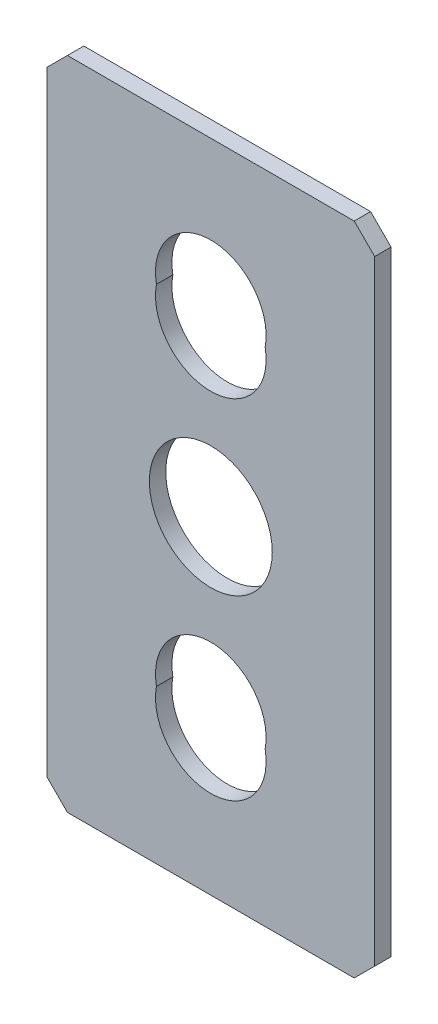
ISO-10303-21;
HEADER;
FILE_DESCRIPTION(('STEP AP214'),'2;1');
FILE_NAME('part.step','',(''),(''),'','','');
FILE_SCHEMA(('AUTOMOTIVE_DESIGN { 1 0 10303 214 1 1 1 1 }'));
ENDSEC;
DATA;
#1=APPLICATION_CONTEXT('core data for automotive mechanical design processes');
#2=APPLICATION_PROTOCOL_DEFINITION('international standard','automotive_design',2000,#1);
#3=PRODUCT_CONTEXT('',#1,'mechanical');
#4=PRODUCT('Part','Part','',(#3));
#5=PRODUCT_RELATED_PRODUCT_CATEGORY('part','',(#4));
#6=PRODUCT_DEFINITION_FORMATION('','',#4);
#7=PRODUCT_DEFINITION_CONTEXT('part definition',#1,'design');
#8=PRODUCT_DEFINITION('design','',#6,#7);
#9=PRODUCT_DEFINITION_SHAPE('','',#8);
#10=(LENGTH_UNIT() NAMED_UNIT(*) SI_UNIT(.MILLI.,.METRE.));
#11=(NAMED_UNIT(*) PLANE_ANGLE_UNIT() SI_UNIT($,.RADIAN.));
#12=(NAMED_UNIT(*) SI_UNIT($,.STERADIAN.) SOLID_ANGLE_UNIT());
#13=UNCERTAINTY_MEASURE_WITH_UNIT(LENGTH_MEASURE(1.E-05),#10,'distance_accuracy_value','');
#14=(GEOMETRIC_REPRESENTATION_CONTEXT(3) GLOBAL_UNCERTAINTY_ASSIGNED_CONTEXT((#13)) GLOBAL_UNIT_ASSIGNED_CONTEXT((#10,
#11,#12)) REPRESENTATION_CONTEXT('',''));
#15=CARTESIAN_POINT('',(0.,0.,0.));
#16=DIRECTION('',(0.,0.,1.));
#17=DIRECTION('',(1.,0.,0.));
#18=AXIS2_PLACEMENT_3D('',#15,#16,#17);
#19=CARTESIAN_POINT('',(-20.,-40.,-2.));
#20=DIRECTION('',(-1.,0.,0.));
#21=DIRECTION('',(0.,0.,1.));
#22=AXIS2_PLACEMENT_3D('',#19,#20,#21);
#23=PLANE('',#22);
#24=DIRECTION('',(0.,-1.,0.));
#25=VECTOR('',#24,1.);
#26=CARTESIAN_POINT('',(-20.,-40.,-2.));
#27=LINE('',#26,#25);
#28=CARTESIAN_POINT('',(-20.,37.5,-2.));
#29=VERTEX_POINT('',#28);
#30=CARTESIAN_POINT('',(-20.,-37.5,-2.));
#31=VERTEX_POINT('',#30);
#32=EDGE_CURVE('E164',#29,#31,#27,.T.);
#33=ORIENTED_EDGE('',*,*,#32,.T.);
#34=DIRECTION('',(0.,0.,1.));
#35=VECTOR('',#34,1.);
#36=CARTESIAN_POINT('',(-20.,-37.5,-2.));
#37=LINE('',#36,#35);
#38=CARTESIAN_POINT('',(-20.,-37.5,0.));
#39=VERTEX_POINT('',#38);
#40=EDGE_CURVE('E197',#31,#39,#37,.T.);
#41=ORIENTED_EDGE('',*,*,#40,.T.);
#42=DIRECTION('',(0.,-1.,0.));
#43=VECTOR('',#42,1.);
#44=CARTESIAN_POINT('',(-20.,-40.,0.));
#45=LINE('',#44,#43);
#46=CARTESIAN_POINT('',(-20.,37.5,0.));
#47=VERTEX_POINT('',#46);
#48=EDGE_CURVE('E177',#47,#39,#45,.T.);
#49=ORIENTED_EDGE('',*,*,#48,.F.);
#50=DIRECTION('',(0.,0.,-1.));
#51=VECTOR('',#50,1.);
#52=CARTESIAN_POINT('',(-20.,37.5,-2.));
#53=LINE('',#52,#51);
#54=EDGE_CURVE('E148',#47,#29,#53,.T.);
#55=ORIENTED_EDGE('',*,*,#54,.T.);
#56=EDGE_LOOP('',(#33,#41,#49,#55));
#57=FACE_BOUND('',#56,.T.);
#58=ADVANCED_FACE('F39',(#57),#23,.T.);
#59=CARTESIAN_POINT('',(20.,40.,-2.));
#60=DIRECTION('',(0.,1.,0.));
#61=DIRECTION('',(-1.,0.,0.));
#62=AXIS2_PLACEMENT_3D('',#59,#60,#61);
#63=PLANE('',#62);
#64=DIRECTION('',(-1.,0.,0.));
#65=VECTOR('',#64,1.);
#66=CARTESIAN_POINT('',(20.,40.,-2.));
#67=LINE('',#66,#65);
#68=CARTESIAN_POINT('',(17.5,40.,-2.));
#69=VERTEX_POINT('',#68);
#70=CARTESIAN_POINT('',(-17.5,40.,-2.));
#71=VERTEX_POINT('',#70);
#72=EDGE_CURVE('E173',#69,#71,#67,.T.);
#73=ORIENTED_EDGE('',*,*,#72,.T.);
#74=DIRECTION('',(0.,0.,1.));
#75=VECTOR('',#74,1.);
#76=CARTESIAN_POINT('',(-17.5,40.,-2.));
#77=LINE('',#76,#75);
#78=CARTESIAN_POINT('',(-17.5,40.,0.));
#79=VERTEX_POINT('',#78);
#80=EDGE_CURVE('E11',#71,#79,#77,.T.);
#81=ORIENTED_EDGE('',*,*,#80,.T.);
#82=DIRECTION('',(-1.,0.,0.));
#83=VECTOR('',#82,1.);
#84=CARTESIAN_POINT('',(20.,40.,0.));
#85=LINE('',#84,#83);
#86=CARTESIAN_POINT('',(17.5,40.,0.));
#87=VERTEX_POINT('',#86);
#88=EDGE_CURVE('E168',#87,#79,#85,.T.);
#89=ORIENTED_EDGE('',*,*,#88,.F.);
#90=DIRECTION('',(0.,0.,-1.));
#91=VECTOR('',#90,1.);
#92=CARTESIAN_POINT('',(17.5,40.,-2.));
#93=LINE('',#92,#91);
#94=EDGE_CURVE('E47',#87,#69,#93,.T.);
#95=ORIENTED_EDGE('',*,*,#94,.T.);
#96=EDGE_LOOP('',(#73,#81,#89,#95));
#97=FACE_BOUND('',#96,.T.);
#98=ADVANCED_FACE('F226',(#97),#63,.T.);
#99=CARTESIAN_POINT('',(20.,-40.,-2.));
#100=DIRECTION('',(1.,0.,0.));
#101=DIRECTION('',(0.,0.,-1.));
#102=AXIS2_PLACEMENT_3D('',#99,#100,#101);
#103=PLANE('',#102);
#104=DIRECTION('',(0.,1.,0.));
#105=VECTOR('',#104,1.);
#106=CARTESIAN_POINT('',(20.,-40.,0.));
#107=LINE('',#106,#105);
#108=CARTESIAN_POINT('',(20.,-37.5,0.));
#109=VERTEX_POINT('',#108);
#110=CARTESIAN_POINT('',(20.,37.5,0.));
#111=VERTEX_POINT('',#110);
#112=EDGE_CURVE('E183',#109,#111,#107,.T.);
#113=ORIENTED_EDGE('',*,*,#112,.F.);
#114=DIRECTION('',(0.,0.,-1.));
#115=VECTOR('',#114,1.);
#116=CARTESIAN_POINT('',(20.,-37.5,-2.));
#117=LINE('',#116,#115);
#118=CARTESIAN_POINT('',(20.,-37.5,-2.));
#119=VERTEX_POINT('',#118);
#120=EDGE_CURVE('E61',#109,#119,#117,.T.);
#121=ORIENTED_EDGE('',*,*,#120,.T.);
#122=DIRECTION('',(0.,1.,0.));
#123=VECTOR('',#122,1.);
#124=CARTESIAN_POINT('',(20.,-40.,-2.));
#125=LINE('',#124,#123);
#126=CARTESIAN_POINT('',(20.,37.5,-2.));
#127=VERTEX_POINT('',#126);
#128=EDGE_CURVE('E171',#119,#127,#125,.T.);
#129=ORIENTED_EDGE('',*,*,#128,.T.);
#130=DIRECTION('',(0.,0.,1.));
#131=VECTOR('',#130,1.);
#132=CARTESIAN_POINT('',(20.,37.5,-2.));
#133=LINE('',#132,#131);
#134=EDGE_CURVE('E220',#127,#111,#133,.T.);
#135=ORIENTED_EDGE('',*,*,#134,.T.);
#136=EDGE_LOOP('',(#113,#121,#129,#135));
#137=FACE_BOUND('',#136,.T.);
#138=ADVANCED_FACE('F234',(#137),#103,.T.);
#139=CARTESIAN_POINT('',(20.,-40.,-2.));
#140=DIRECTION('',(0.,-1.,0.));
#141=DIRECTION('',(1.,0.,0.));
#142=AXIS2_PLACEMENT_3D('',#139,#140,#141);
#143=PLANE('',#142);
#144=DIRECTION('',(1.,0.,0.));
#145=VECTOR('',#144,1.);
#146=CARTESIAN_POINT('',(20.,-40.,0.));
#147=LINE('',#146,#145);
#148=CARTESIAN_POINT('',(-17.5,-40.,0.));
#149=VERTEX_POINT('',#148);
#150=CARTESIAN_POINT('',(17.5,-40.,0.));
#151=VERTEX_POINT('',#150);
#152=EDGE_CURVE('E180',#149,#151,#147,.T.);
#153=ORIENTED_EDGE('',*,*,#152,.F.);
#154=DIRECTION('',(0.,0.,-1.));
#155=VECTOR('',#154,1.);
#156=CARTESIAN_POINT('',(-17.5,-40.,-2.));
#157=LINE('',#156,#155);
#158=CARTESIAN_POINT('',(-17.5,-40.,-2.));
#159=VERTEX_POINT('',#158);
#160=EDGE_CURVE('E211',#149,#159,#157,.T.);
#161=ORIENTED_EDGE('',*,*,#160,.T.);
#162=DIRECTION('',(1.,0.,0.));
#163=VECTOR('',#162,1.);
#164=CARTESIAN_POINT('',(20.,-40.,-2.));
#165=LINE('',#164,#163);
#166=CARTESIAN_POINT('',(17.5,-40.,-2.));
#167=VERTEX_POINT('',#166);
#168=EDGE_CURVE('E167',#159,#167,#165,.T.);
#169=ORIENTED_EDGE('',*,*,#168,.T.);
#170=DIRECTION('',(0.,0.,1.));
#171=VECTOR('',#170,1.);
#172=CARTESIAN_POINT('',(17.5,-40.,-2.));
#173=LINE('',#172,#171);
#174=EDGE_CURVE('E208',#167,#151,#173,.T.);
#175=ORIENTED_EDGE('',*,*,#174,.T.);
#176=EDGE_LOOP('',(#153,#161,#169,#175));
#177=FACE_BOUND('',#176,.T.);
#178=ADVANCED_FACE('F242',(#177),#143,.T.);
#179=CARTESIAN_POINT('',(0.,0.,-2.));
#180=DIRECTION('',(0.,0.,1.));
#181=DIRECTION('',(1.,0.,0.));
#182=AXIS2_PLACEMENT_3D('',#179,#180,#181);
#183=PLANE('',#182);
#184=CARTESIAN_POINT('',(0.,0.,-2.));
#185=DIRECTION('',(0.,0.,1.));
#186=DIRECTION('',(1.,0.,0.));
#187=AXIS2_PLACEMENT_3D('',#184,#185,#186);
#188=CIRCLE('',#187,7.5);
#189=CARTESIAN_POINT('',(7.5,0.,-2.));
#190=VERTEX_POINT('',#189);
#191=EDGE_CURVE('E140',#190,#190,#188,.T.);
#192=ORIENTED_EDGE('',*,*,#191,.T.);
#193=EDGE_LOOP('',(#192));
#194=FACE_BOUND('',#193,.T.);
#195=CARTESIAN_POINT('',(0.,22.5,-2.));
#196=DIRECTION('',(0.,0.,1.));
#197=DIRECTION('',(1.,0.,0.));
#198=AXIS2_PLACEMENT_3D('',#195,#196,#197);
#199=CIRCLE('',#198,6.75);
#200=CARTESIAN_POINT('',(6.6332495807108,21.25,-2.));
#201=VERTEX_POINT('',#200);
#202=CARTESIAN_POINT('',(-6.63324958071079,21.25,-2.));
#203=VERTEX_POINT('',#202);
#204=EDGE_CURVE('E147',#201,#203,#199,.T.);
#205=ORIENTED_EDGE('',*,*,#204,.T.);
#206=CARTESIAN_POINT('',(0.,20.,-2.));
#207=DIRECTION('',(0.,0.,1.));
#208=DIRECTION('',(1.,0.,0.));
#209=AXIS2_PLACEMENT_3D('',#206,#207,#208);
#210=CIRCLE('',#209,6.75);
#211=EDGE_CURVE('E139',#203,#201,#210,.T.);
#212=ORIENTED_EDGE('',*,*,#211,.T.);
#213=EDGE_LOOP('',(#205,#212));
#214=FACE_BOUND('',#213,.T.);
#215=CARTESIAN_POINT('',(0.,-22.5,-2.));
#216=DIRECTION('',(0.,0.,1.));
#217=DIRECTION('',(1.,0.,0.));
#218=AXIS2_PLACEMENT_3D('',#215,#216,#217);
#219=CIRCLE('',#218,6.75);
#220=CARTESIAN_POINT('',(-6.63324958071079,-21.25,-2.));
#221=VERTEX_POINT('',#220);
#222=CARTESIAN_POINT('',(6.6332495807108,-21.25,-2.));
#223=VERTEX_POINT('',#222);
#224=EDGE_CURVE('E163',#221,#223,#219,.T.);
#225=ORIENTED_EDGE('',*,*,#224,.T.);
#226=CARTESIAN_POINT('',(0.,-20.,-2.));
#227=DIRECTION('',(0.,0.,1.));
#228=DIRECTION('',(1.,0.,0.));
#229=AXIS2_PLACEMENT_3D('',#226,#227,#228);
#230=CIRCLE('',#229,6.75);
#231=EDGE_CURVE('E152',#223,#221,#230,.T.);
#232=ORIENTED_EDGE('',*,*,#231,.T.);
#233=EDGE_LOOP('',(#225,#232));
#234=FACE_BOUND('',#233,.T.);
#235=ORIENTED_EDGE('',*,*,#168,.F.);
#236=DIRECTION('',(0.707106781186549,-0.707106781186546,0.));
#237=VECTOR('',#236,1.);
#238=CARTESIAN_POINT('',(-20.,-37.5,-2.));
#239=LINE('',#238,#237);
#240=EDGE_CURVE('E218',#159,#31,#239,.F.);
#241=ORIENTED_EDGE('',*,*,#240,.T.);
#242=ORIENTED_EDGE('',*,*,#32,.F.);
#243=DIRECTION('',(-0.707106781186548,-0.707106781186548,0.));
#244=VECTOR('',#243,1.);
#245=CARTESIAN_POINT('',(-17.5,40.,-2.));
#246=LINE('',#245,#244);
#247=EDGE_CURVE('E214',#29,#71,#246,.F.);
#248=ORIENTED_EDGE('',*,*,#247,.T.);
#249=ORIENTED_EDGE('',*,*,#72,.F.);
#250=DIRECTION('',(-0.707106781186548,0.707106781186548,0.));
#251=VECTOR('',#250,1.);
#252=CARTESIAN_POINT('',(20.,37.5,-2.));
#253=LINE('',#252,#251);
#254=EDGE_CURVE('E54',#69,#127,#253,.F.);
#255=ORIENTED_EDGE('',*,*,#254,.T.);
#256=ORIENTED_EDGE('',*,*,#128,.F.);
#257=DIRECTION('',(0.707106781186546,0.707106781186549,0.));
#258=VECTOR('',#257,1.);
#259=CARTESIAN_POINT('',(17.5,-40.,-2.));
#260=LINE('',#259,#258);
#261=EDGE_CURVE('E216',#119,#167,#260,.F.);
#262=ORIENTED_EDGE('',*,*,#261,.T.);
#263=EDGE_LOOP('',(#235,#241,#242,#248,#249,#255,#256,#262));
#264=FACE_BOUND('',#263,.T.);
#265=ADVANCED_FACE('F230',(#194,#214,#234,#264),#183,.F.);
#266=CARTESIAN_POINT('',(0.,0.,0.));
#267=DIRECTION('',(0.,0.,1.));
#268=DIRECTION('',(1.,0.,0.));
#269=AXIS2_PLACEMENT_3D('',#266,#267,#268);
#270=PLANE('',#269);
#271=CARTESIAN_POINT('',(0.,0.,0.));
#272=DIRECTION('',(0.,0.,1.));
#273=DIRECTION('',(1.,0.,0.));
#274=AXIS2_PLACEMENT_3D('',#271,#272,#273);
#275=CIRCLE('',#274,7.5);
#276=CARTESIAN_POINT('',(7.5,0.,0.));
#277=VERTEX_POINT('',#276);
#278=EDGE_CURVE('E396',#277,#277,#275,.T.);
#279=ORIENTED_EDGE('',*,*,#278,.F.);
#280=EDGE_LOOP('',(#279));
#281=FACE_BOUND('',#280,.T.);
#282=CARTESIAN_POINT('',(0.,20.,0.));
#283=DIRECTION('',(0.,0.,1.));
#284=DIRECTION('',(1.,0.,0.));
#285=AXIS2_PLACEMENT_3D('',#282,#283,#284);
#286=CIRCLE('',#285,6.75);
#287=CARTESIAN_POINT('',(-6.63324958071079,21.25,0.));
#288=VERTEX_POINT('',#287);
#289=CARTESIAN_POINT('',(6.6332495807108,21.25,0.));
#290=VERTEX_POINT('',#289);
#291=EDGE_CURVE('E129',#288,#290,#286,.T.);
#292=ORIENTED_EDGE('',*,*,#291,.F.);
#293=CARTESIAN_POINT('',(0.,22.5,0.));
#294=DIRECTION('',(0.,0.,1.));
#295=DIRECTION('',(1.,0.,0.));
#296=AXIS2_PLACEMENT_3D('',#293,#294,#295);
#297=CIRCLE('',#296,6.75);
#298=EDGE_CURVE('E145',#290,#288,#297,.T.);
#299=ORIENTED_EDGE('',*,*,#298,.F.);
#300=EDGE_LOOP('',(#292,#299));
#301=FACE_BOUND('',#300,.T.);
#302=CARTESIAN_POINT('',(0.,-20.,0.));
#303=DIRECTION('',(0.,0.,1.));
#304=DIRECTION('',(1.,0.,0.));
#305=AXIS2_PLACEMENT_3D('',#302,#303,#304);
#306=CIRCLE('',#305,6.75);
#307=CARTESIAN_POINT('',(6.6332495807108,-21.25,0.));
#308=VERTEX_POINT('',#307);
#309=CARTESIAN_POINT('',(-6.63324958071079,-21.25,0.));
#310=VERTEX_POINT('',#309);
#311=EDGE_CURVE('E157',#308,#310,#306,.T.);
#312=ORIENTED_EDGE('',*,*,#311,.F.);
#313=CARTESIAN_POINT('',(0.,-22.5,0.));
#314=DIRECTION('',(0.,0.,1.));
#315=DIRECTION('',(1.,0.,0.));
#316=AXIS2_PLACEMENT_3D('',#313,#314,#315);
#317=CIRCLE('',#316,6.75);
#318=EDGE_CURVE('E154',#310,#308,#317,.T.);
#319=ORIENTED_EDGE('',*,*,#318,.F.);
#320=EDGE_LOOP('',(#312,#319));
#321=FACE_BOUND('',#320,.T.);
#322=ORIENTED_EDGE('',*,*,#48,.T.);
#323=DIRECTION('',(-0.707106781186549,0.707106781186546,0.));
#324=VECTOR('',#323,1.);
#325=CARTESIAN_POINT('',(-28.7499999999999,-28.7500000000001,0.));
#326=LINE('',#325,#324);
#327=EDGE_CURVE('E206',#39,#149,#326,.F.);
#328=ORIENTED_EDGE('',*,*,#327,.T.);
#329=ORIENTED_EDGE('',*,*,#152,.T.);
#330=DIRECTION('',(-0.707106781186546,-0.707106781186549,0.));
#331=VECTOR('',#330,1.);
#332=CARTESIAN_POINT('',(28.75,-28.7499999999999,0.));
#333=LINE('',#332,#331);
#334=EDGE_CURVE('E204',#151,#109,#333,.F.);
#335=ORIENTED_EDGE('',*,*,#334,.T.);
#336=ORIENTED_EDGE('',*,*,#112,.T.);
#337=DIRECTION('',(0.707106781186548,-0.707106781186548,0.));
#338=VECTOR('',#337,1.);
#339=CARTESIAN_POINT('',(28.75,28.75,0.));
#340=LINE('',#339,#338);
#341=EDGE_CURVE('E200',#111,#87,#340,.F.);
#342=ORIENTED_EDGE('',*,*,#341,.T.);
#343=ORIENTED_EDGE('',*,*,#88,.T.);
#344=DIRECTION('',(0.707106781186548,0.707106781186548,0.));
#345=VECTOR('',#344,1.);
#346=CARTESIAN_POINT('',(-28.75,28.75,0.));
#347=LINE('',#346,#345);
#348=EDGE_CURVE('E202',#79,#47,#347,.F.);
#349=ORIENTED_EDGE('',*,*,#348,.T.);
#350=EDGE_LOOP('',(#322,#328,#329,#335,#336,#342,#343,#349));
#351=FACE_BOUND('',#350,.T.);
#352=ADVANCED_FACE('F150',(#281,#301,#321,#351),#270,.T.);
#353=CARTESIAN_POINT('',(0.,-22.5,0.));
#354=DIRECTION('',(0.,0.,1.));
#355=DIRECTION('',(1.,0.,0.));
#356=AXIS2_PLACEMENT_3D('',#353,#354,#355);
#357=CYLINDRICAL_SURFACE('',#356,6.75);
#358=ORIENTED_EDGE('',*,*,#224,.F.);
#359=DIRECTION('',(0.,0.,1.));
#360=VECTOR('',#359,1.);
#361=CARTESIAN_POINT('',(-6.63324958071079,-21.25,-11.125));
#362=LINE('',#361,#360);
#363=EDGE_CURVE('E192',#221,#310,#362,.T.);
#364=ORIENTED_EDGE('',*,*,#363,.T.);
#365=ORIENTED_EDGE('',*,*,#318,.T.);
#366=DIRECTION('',(0.,0.,1.));
#367=VECTOR('',#366,1.);
#368=CARTESIAN_POINT('',(6.6332495807108,-21.25,-11.125));
#369=LINE('',#368,#367);
#370=EDGE_CURVE('E176',#308,#223,#369,.F.);
#371=ORIENTED_EDGE('',*,*,#370,.T.);
#372=EDGE_LOOP('',(#358,#364,#365,#371));
#373=FACE_BOUND('',#372,.T.);
#374=ADVANCED_FACE('F288',(#373),#357,.F.);
#375=CARTESIAN_POINT('',(0.,22.5,0.));
#376=DIRECTION('',(0.,0.,1.));
#377=DIRECTION('',(1.,0.,0.));
#378=AXIS2_PLACEMENT_3D('',#375,#376,#377);
#379=CYLINDRICAL_SURFACE('',#378,6.75);
#380=ORIENTED_EDGE('',*,*,#204,.F.);
#381=DIRECTION('',(0.,0.,1.));
#382=VECTOR('',#381,1.);
#383=CARTESIAN_POINT('',(6.6332495807108,21.25,-11.125));
#384=LINE('',#383,#382);
#385=EDGE_CURVE('E132',#201,#290,#384,.T.);
#386=ORIENTED_EDGE('',*,*,#385,.T.);
#387=ORIENTED_EDGE('',*,*,#298,.T.);
#388=DIRECTION('',(0.,0.,1.));
#389=VECTOR('',#388,1.);
#390=CARTESIAN_POINT('',(-6.63324958071079,21.25,-11.125));
#391=LINE('',#390,#389);
#392=EDGE_CURVE('E135',#288,#203,#391,.F.);
#393=ORIENTED_EDGE('',*,*,#392,.T.);
#394=EDGE_LOOP('',(#380,#386,#387,#393));
#395=FACE_BOUND('',#394,.T.);
#396=ADVANCED_FACE('F144',(#395),#379,.F.);
#397=CARTESIAN_POINT('',(0.,-20.,0.));
#398=DIRECTION('',(0.,0.,1.));
#399=DIRECTION('',(1.,0.,0.));
#400=AXIS2_PLACEMENT_3D('',#397,#398,#399);
#401=CYLINDRICAL_SURFACE('',#400,6.75);
#402=ORIENTED_EDGE('',*,*,#231,.F.);
#403=ORIENTED_EDGE('',*,*,#370,.F.);
#404=ORIENTED_EDGE('',*,*,#311,.T.);
#405=ORIENTED_EDGE('',*,*,#363,.F.);
#406=EDGE_LOOP('',(#402,#403,#404,#405));
#407=FACE_BOUND('',#406,.T.);
#408=ADVANCED_FACE('F278',(#407),#401,.F.);
#409=CARTESIAN_POINT('',(0.,20.,0.));
#410=DIRECTION('',(0.,0.,1.));
#411=DIRECTION('',(1.,0.,0.));
#412=AXIS2_PLACEMENT_3D('',#409,#410,#411);
#413=CYLINDRICAL_SURFACE('',#412,6.75);
#414=ORIENTED_EDGE('',*,*,#211,.F.);
#415=ORIENTED_EDGE('',*,*,#392,.F.);
#416=ORIENTED_EDGE('',*,*,#291,.T.);
#417=ORIENTED_EDGE('',*,*,#385,.F.);
#418=EDGE_LOOP('',(#414,#415,#416,#417));
#419=FACE_BOUND('',#418,.T.);
#420=ADVANCED_FACE('F131',(#419),#413,.F.);
#421=CARTESIAN_POINT('',(0.,0.,-10.));
#422=DIRECTION('',(0.,0.,1.));
#423=DIRECTION('',(1.,0.,0.));
#424=AXIS2_PLACEMENT_3D('',#421,#422,#423);
#425=CYLINDRICAL_SURFACE('',#424,7.5);
#426=ORIENTED_EDGE('',*,*,#278,.T.);
#427=EDGE_LOOP('',(#426));
#428=FACE_BOUND('',#427,.T.);
#429=ORIENTED_EDGE('',*,*,#191,.F.);
#430=EDGE_LOOP('',(#429));
#431=FACE_BOUND('',#430,.T.);
#432=ADVANCED_FACE('F269',(#428,#431),#425,.F.);
#433=CARTESIAN_POINT('',(-20.,-37.5,-2.));
#434=DIRECTION('',(0.707106781186545,0.707106781186549,0.));
#435=DIRECTION('',(0.,0.,1.));
#436=AXIS2_PLACEMENT_3D('',#433,#434,#435);
#437=PLANE('',#436);
#438=ORIENTED_EDGE('',*,*,#240,.F.);
#439=ORIENTED_EDGE('',*,*,#160,.F.);
#440=ORIENTED_EDGE('',*,*,#327,.F.);
#441=ORIENTED_EDGE('',*,*,#40,.F.);
#442=EDGE_LOOP('',(#438,#439,#440,#441));
#443=FACE_BOUND('',#442,.T.);
#444=ADVANCED_FACE('F247',(#443),#437,.F.);
#445=CARTESIAN_POINT('',(17.5,-40.,-2.));
#446=DIRECTION('',(-0.707106781186549,0.707106781186546,0.));
#447=DIRECTION('',(0.,0.,1.));
#448=AXIS2_PLACEMENT_3D('',#445,#446,#447);
#449=PLANE('',#448);
#450=ORIENTED_EDGE('',*,*,#261,.F.);
#451=ORIENTED_EDGE('',*,*,#120,.F.);
#452=ORIENTED_EDGE('',*,*,#334,.F.);
#453=ORIENTED_EDGE('',*,*,#174,.F.);
#454=EDGE_LOOP('',(#450,#451,#452,#453));
#455=FACE_BOUND('',#454,.T.);
#456=ADVANCED_FACE('F240',(#455),#449,.F.);
#457=CARTESIAN_POINT('',(-17.5,40.,-2.));
#458=DIRECTION('',(0.707106781186547,-0.707106781186547,0.));
#459=DIRECTION('',(0.,0.,1.));
#460=AXIS2_PLACEMENT_3D('',#457,#458,#459);
#461=PLANE('',#460);
#462=ORIENTED_EDGE('',*,*,#247,.F.);
#463=ORIENTED_EDGE('',*,*,#54,.F.);
#464=ORIENTED_EDGE('',*,*,#348,.F.);
#465=ORIENTED_EDGE('',*,*,#80,.F.);
#466=EDGE_LOOP('',(#462,#463,#464,#465));
#467=FACE_BOUND('',#466,.T.);
#468=ADVANCED_FACE('F252',(#467),#461,.F.);
#469=CARTESIAN_POINT('',(20.,37.5,-2.));
#470=DIRECTION('',(-0.707106781186547,-0.707106781186547,0.));
#471=DIRECTION('',(0.,0.,1.));
#472=AXIS2_PLACEMENT_3D('',#469,#470,#471);
#473=PLANE('',#472);
#474=ORIENTED_EDGE('',*,*,#254,.F.);
#475=ORIENTED_EDGE('',*,*,#94,.F.);
#476=ORIENTED_EDGE('',*,*,#341,.F.);
#477=ORIENTED_EDGE('',*,*,#134,.F.);
#478=EDGE_LOOP('',(#474,#475,#476,#477));
#479=FACE_BOUND('',#478,.T.);
#480=ADVANCED_FACE('F41',(#479),#473,.F.);
#481=CLOSED_SHELL('',(#58,#98,#138,#178,#265,#352,#374,#396,#408,#420,#432,#444,#456,#468,#480));
#482=MANIFOLD_SOLID_BREP('B2',#481);
#483=ADVANCED_BREP_SHAPE_REPRESENTATION('',(#18,#482),#14);
#484=SHAPE_DEFINITION_REPRESENTATION(#9,#483);
ENDSEC;
END-ISO-10303-21;
